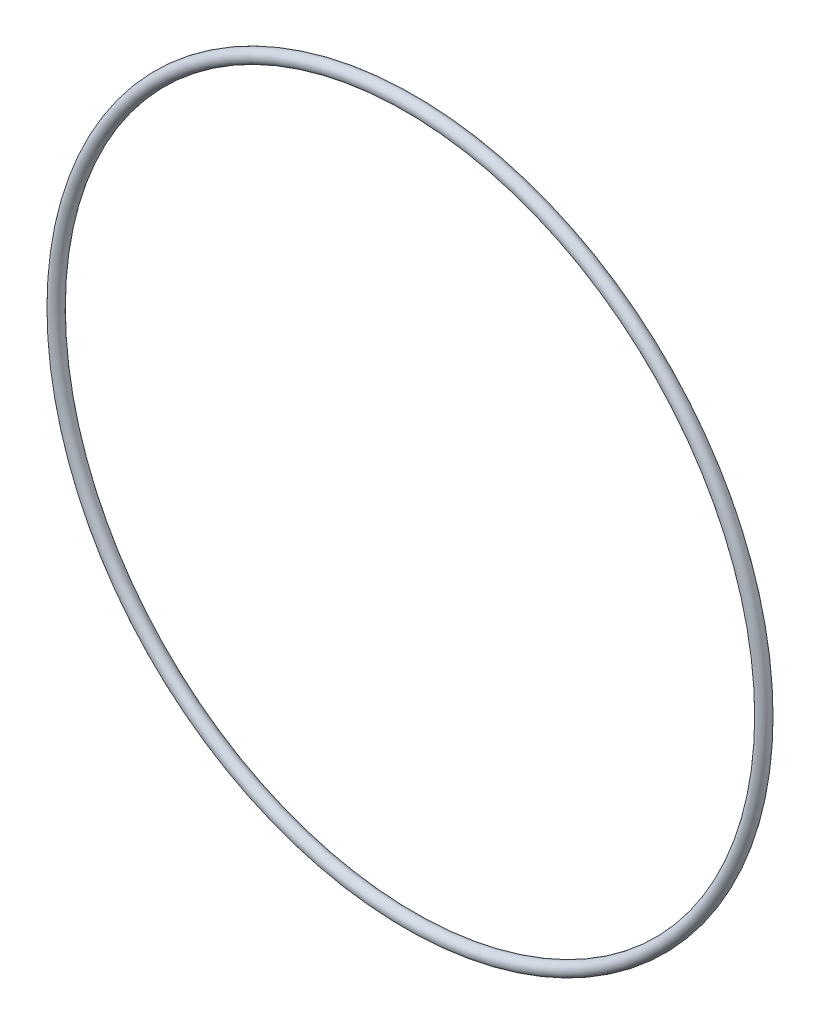
ISO-10303-21;
HEADER;
FILE_DESCRIPTION(('STEP AP214'),'2;1');
FILE_NAME('part.step','',(''),(''),'','','');
FILE_SCHEMA(('AUTOMOTIVE_DESIGN { 1 0 10303 214 1 1 1 1 }'));
ENDSEC;
DATA;
#1=APPLICATION_CONTEXT('core data for automotive mechanical design processes');
#2=APPLICATION_PROTOCOL_DEFINITION('international standard','automotive_design',2000,#1);
#3=PRODUCT_CONTEXT('',#1,'mechanical');
#4=PRODUCT('Part','Part','',(#3));
#5=PRODUCT_RELATED_PRODUCT_CATEGORY('part','',(#4));
#6=PRODUCT_DEFINITION_FORMATION('','',#4);
#7=PRODUCT_DEFINITION_CONTEXT('part definition',#1,'design');
#8=PRODUCT_DEFINITION('design','',#6,#7);
#9=PRODUCT_DEFINITION_SHAPE('','',#8);
#10=(LENGTH_UNIT() NAMED_UNIT(*) SI_UNIT(.MILLI.,.METRE.));
#11=(NAMED_UNIT(*) PLANE_ANGLE_UNIT() SI_UNIT($,.RADIAN.));
#12=(NAMED_UNIT(*) SI_UNIT($,.STERADIAN.) SOLID_ANGLE_UNIT());
#13=UNCERTAINTY_MEASURE_WITH_UNIT(LENGTH_MEASURE(1.E-05),#10,'distance_accuracy_value','');
#14=(GEOMETRIC_REPRESENTATION_CONTEXT(3) GLOBAL_UNCERTAINTY_ASSIGNED_CONTEXT((#13)) GLOBAL_UNIT_ASSIGNED_CONTEXT((#10,
#11,#12)) REPRESENTATION_CONTEXT('',''));
#15=CARTESIAN_POINT('',(0.,0.,0.));
#16=DIRECTION('',(0.,0.,1.));
#17=DIRECTION('',(1.,0.,0.));
#18=AXIS2_PLACEMENT_3D('',#15,#16,#17);
#19=CARTESIAN_POINT('',(0.,0.,0.));
#20=DIRECTION('',(0.,0.,1.));
#21=DIRECTION('',(1.,0.,0.));
#22=AXIS2_PLACEMENT_3D('',#19,#20,#21);
#23=TOROIDAL_SURFACE('',#22,48.3743,0.889000000000003);
#24=CARTESIAN_POINT('',(49.2633,0.,0.));
#25=VERTEX_POINT('',#24);
#26=VERTEX_LOOP('',#25);
#27=FACE_BOUND('',#26,.T.);
#28=ADVANCED_FACE('F33',(#27),#23,.T.);
#29=CLOSED_SHELL('',(#28));
#30=MANIFOLD_SOLID_BREP('B2',#29);
#31=ADVANCED_BREP_SHAPE_REPRESENTATION('',(#18,#30),#14);
#32=SHAPE_DEFINITION_REPRESENTATION(#9,#31);
ENDSEC;
END-ISO-10303-21;
